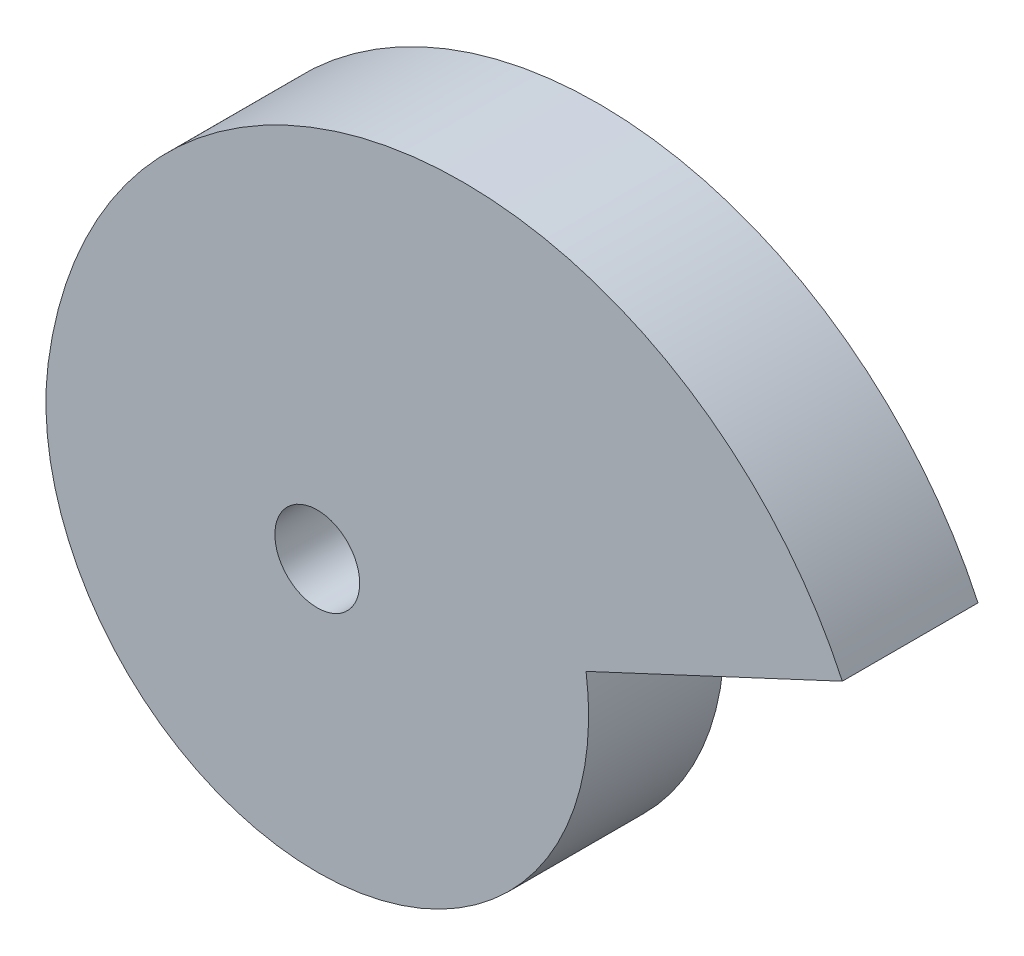
ISO-10303-21;
HEADER;
FILE_DESCRIPTION(('STEP AP214'),'2;1');
FILE_NAME('part.step','',(''),(''),'','','');
FILE_SCHEMA(('AUTOMOTIVE_DESIGN { 1 0 10303 214 1 1 1 1 }'));
ENDSEC;
DATA;
#1=APPLICATION_CONTEXT('core data for automotive mechanical design processes');
#2=APPLICATION_PROTOCOL_DEFINITION('international standard','automotive_design',2000,#1);
#3=PRODUCT_CONTEXT('',#1,'mechanical');
#4=PRODUCT('Part','Part','',(#3));
#5=PRODUCT_RELATED_PRODUCT_CATEGORY('part','',(#4));
#6=PRODUCT_DEFINITION_FORMATION('','',#4);
#7=PRODUCT_DEFINITION_CONTEXT('part definition',#1,'design');
#8=PRODUCT_DEFINITION('design','',#6,#7);
#9=PRODUCT_DEFINITION_SHAPE('','',#8);
#10=(LENGTH_UNIT() NAMED_UNIT(*) SI_UNIT(.MILLI.,.METRE.));
#11=(NAMED_UNIT(*) PLANE_ANGLE_UNIT() SI_UNIT($,.RADIAN.));
#12=(NAMED_UNIT(*) SI_UNIT($,.STERADIAN.) SOLID_ANGLE_UNIT());
#13=UNCERTAINTY_MEASURE_WITH_UNIT(LENGTH_MEASURE(1.E-05),#10,'distance_accuracy_value','');
#14=(GEOMETRIC_REPRESENTATION_CONTEXT(3) GLOBAL_UNCERTAINTY_ASSIGNED_CONTEXT((#13)) GLOBAL_UNIT_ASSIGNED_CONTEXT((#10,
#11,#12)) REPRESENTATION_CONTEXT('',''));
#15=CARTESIAN_POINT('',(0.,0.,0.));
#16=DIRECTION('',(0.,0.,1.));
#17=DIRECTION('',(1.,0.,0.));
#18=AXIS2_PLACEMENT_3D('',#15,#16,#17);
#19=CARTESIAN_POINT('',(42.9025100512141,-5.55899705018577,40.));
#20=DIRECTION('',(0.,0.,-1.));
#21=DIRECTION('',(-1.,0.,0.));
#22=AXIS2_PLACEMENT_3D('',#19,#20,#21);
#23=CYLINDRICAL_SURFACE('',#22,123.261158293537);
#24=CARTESIAN_POINT('',(42.9025100512141,-5.55899705018577,0.));
#25=DIRECTION('',(0.,0.,1.));
#26=DIRECTION('',(-1.,0.,0.));
#27=AXIS2_PLACEMENT_3D('',#24,#25,#26);
#28=CIRCLE('',#27,123.261158293537);
#29=CARTESIAN_POINT('',(154.789932001286,46.1567447817859,0.));
#30=VERTEX_POINT('',#29);
#31=CARTESIAN_POINT('',(-79.3367755160141,10.2798857348509,0.));
#32=VERTEX_POINT('',#31);
#33=EDGE_CURVE('E88',#30,#32,#28,.T.);
#34=ORIENTED_EDGE('',*,*,#33,.T.);
#35=DIRECTION('',(0.,0.,-1.));
#36=VECTOR('',#35,1.);
#37=CARTESIAN_POINT('',(-79.3367755160141,10.2798857348509,40.));
#38=LINE('',#37,#36);
#39=CARTESIAN_POINT('',(-79.3367755160141,10.2798857348509,40.));
#40=VERTEX_POINT('',#39);
#41=EDGE_CURVE('E11',#40,#32,#38,.T.);
#42=ORIENTED_EDGE('',*,*,#41,.F.);
#43=CARTESIAN_POINT('',(42.9025100512141,-5.55899705018577,40.));
#44=DIRECTION('',(0.,0.,1.));
#45=DIRECTION('',(-1.,0.,0.));
#46=AXIS2_PLACEMENT_3D('',#43,#44,#45);
#47=CIRCLE('',#46,123.261158293537);
#48=CARTESIAN_POINT('',(154.789932001286,46.1567447817859,40.));
#49=VERTEX_POINT('',#48);
#50=EDGE_CURVE('E81',#49,#40,#47,.T.);
#51=ORIENTED_EDGE('',*,*,#50,.F.);
#52=DIRECTION('',(0.,0.,-1.));
#53=VECTOR('',#52,1.);
#54=CARTESIAN_POINT('',(154.789932001286,46.1567447817859,40.));
#55=LINE('',#54,#53);
#56=EDGE_CURVE('E89',#49,#30,#55,.T.);
#57=ORIENTED_EDGE('',*,*,#56,.T.);
#58=EDGE_LOOP('',(#34,#42,#51,#57));
#59=FACE_BOUND('',#58,.T.);
#60=ADVANCED_FACE('F41',(#59),#23,.T.);
#61=CARTESIAN_POINT('',(0.,0.,40.));
#62=DIRECTION('',(0.,0.,-1.));
#63=DIRECTION('',(-1.,0.,0.));
#64=AXIS2_PLACEMENT_3D('',#61,#62,#63);
#65=CYLINDRICAL_SURFACE('',#64,80.);
#66=CARTESIAN_POINT('',(0.,0.,0.));
#67=DIRECTION('',(0.,0.,1.));
#68=DIRECTION('',(1.,0.,0.));
#69=AXIS2_PLACEMENT_3D('',#66,#67,#68);
#70=CIRCLE('',#69,80.);
#71=CARTESIAN_POINT('',(79.2528578289507,10.9080028393895,0.));
#72=VERTEX_POINT('',#71);
#73=EDGE_CURVE('E69',#32,#72,#70,.T.);
#74=ORIENTED_EDGE('',*,*,#73,.T.);
#75=DIRECTION('',(0.,0.,-1.));
#76=VECTOR('',#75,1.);
#77=CARTESIAN_POINT('',(79.2528578289507,10.9080028393895,40.));
#78=LINE('',#77,#76);
#79=CARTESIAN_POINT('',(79.2528578289507,10.9080028393895,40.));
#80=VERTEX_POINT('',#79);
#81=EDGE_CURVE('E49',#80,#72,#78,.T.);
#82=ORIENTED_EDGE('',*,*,#81,.F.);
#83=CARTESIAN_POINT('',(0.,0.,40.));
#84=DIRECTION('',(0.,0.,1.));
#85=DIRECTION('',(1.,0.,0.));
#86=AXIS2_PLACEMENT_3D('',#83,#84,#85);
#87=CIRCLE('',#86,80.);
#88=EDGE_CURVE('E77',#40,#80,#87,.T.);
#89=ORIENTED_EDGE('',*,*,#88,.F.);
#90=ORIENTED_EDGE('',*,*,#41,.T.);
#91=EDGE_LOOP('',(#74,#82,#89,#90));
#92=FACE_BOUND('',#91,.T.);
#93=ADVANCED_FACE('F78',(#92),#65,.T.);
#94=CARTESIAN_POINT('',(154.789932001286,46.1567447817859,40.));
#95=DIRECTION('',(-0.422866820036971,0.906191840898946,0.));
#96=DIRECTION('',(-0.906191840898946,-0.422866820036971,0.));
#97=AXIS2_PLACEMENT_3D('',#94,#95,#96);
#98=PLANE('',#97);
#99=DIRECTION('',(0.906191840898946,0.422866820036971,0.));
#100=VECTOR('',#99,1.);
#101=CARTESIAN_POINT('',(154.789932001286,46.1567447817859,0.));
#102=LINE('',#101,#100);
#103=EDGE_CURVE('E74',#72,#30,#102,.T.);
#104=ORIENTED_EDGE('',*,*,#103,.T.);
#105=ORIENTED_EDGE('',*,*,#56,.F.);
#106=DIRECTION('',(0.906191840898946,0.422866820036971,0.));
#107=VECTOR('',#106,1.);
#108=CARTESIAN_POINT('',(154.789932001286,46.1567447817859,40.));
#109=LINE('',#108,#107);
#110=EDGE_CURVE('E57',#80,#49,#109,.T.);
#111=ORIENTED_EDGE('',*,*,#110,.F.);
#112=ORIENTED_EDGE('',*,*,#81,.T.);
#113=EDGE_LOOP('',(#104,#105,#111,#112));
#114=FACE_BOUND('',#113,.T.);
#115=ADVANCED_FACE('F100',(#114),#98,.F.);
#116=CARTESIAN_POINT('',(42.9025100512141,-5.55899705018577,40.));
#117=DIRECTION('',(0.,0.,-1.));
#118=DIRECTION('',(-1.,0.,0.));
#119=AXIS2_PLACEMENT_3D('',#116,#117,#118);
#120=PLANE('',#119);
#121=CARTESIAN_POINT('',(0.,0.,40.));
#122=DIRECTION('',(0.,0.,1.));
#123=DIRECTION('',(1.,0.,0.));
#124=AXIS2_PLACEMENT_3D('',#121,#122,#123);
#125=CIRCLE('',#124,12.5);
#126=CARTESIAN_POINT('',(12.5,0.,40.));
#127=VERTEX_POINT('',#126);
#128=EDGE_CURVE('E95',#127,#127,#125,.T.);
#129=ORIENTED_EDGE('',*,*,#128,.F.);
#130=EDGE_LOOP('',(#129));
#131=FACE_BOUND('',#130,.T.);
#132=ORIENTED_EDGE('',*,*,#50,.T.);
#133=ORIENTED_EDGE('',*,*,#88,.T.);
#134=ORIENTED_EDGE('',*,*,#110,.T.);
#135=EDGE_LOOP('',(#132,#133,#134));
#136=FACE_BOUND('',#135,.T.);
#137=ADVANCED_FACE('F84',(#131,#136),#120,.F.);
#138=CARTESIAN_POINT('',(42.9025100512141,-5.55899705018577,0.));
#139=DIRECTION('',(0.,0.,-1.));
#140=DIRECTION('',(-1.,0.,0.));
#141=AXIS2_PLACEMENT_3D('',#138,#139,#140);
#142=PLANE('',#141);
#143=CARTESIAN_POINT('',(0.,0.,0.));
#144=DIRECTION('',(0.,0.,1.));
#145=DIRECTION('',(1.,0.,0.));
#146=AXIS2_PLACEMENT_3D('',#143,#144,#145);
#147=CIRCLE('',#146,12.5);
#148=CARTESIAN_POINT('',(12.5,0.,0.));
#149=VERTEX_POINT('',#148);
#150=EDGE_CURVE('E91',#149,#149,#147,.T.);
#151=ORIENTED_EDGE('',*,*,#150,.T.);
#152=EDGE_LOOP('',(#151));
#153=FACE_BOUND('',#152,.T.);
#154=ORIENTED_EDGE('',*,*,#33,.F.);
#155=ORIENTED_EDGE('',*,*,#103,.F.);
#156=ORIENTED_EDGE('',*,*,#73,.F.);
#157=EDGE_LOOP('',(#154,#155,#156));
#158=FACE_BOUND('',#157,.T.);
#159=ADVANCED_FACE('F101',(#153,#158),#142,.T.);
#160=CARTESIAN_POINT('',(0.,0.,0.));
#161=DIRECTION('',(0.,0.,1.));
#162=DIRECTION('',(1.,0.,0.));
#163=AXIS2_PLACEMENT_3D('',#160,#161,#162);
#164=CYLINDRICAL_SURFACE('',#163,12.5);
#165=ORIENTED_EDGE('',*,*,#150,.F.);
#166=EDGE_LOOP('',(#165));
#167=FACE_BOUND('',#166,.T.);
#168=ORIENTED_EDGE('',*,*,#128,.T.);
#169=EDGE_LOOP('',(#168));
#170=FACE_BOUND('',#169,.T.);
#171=ADVANCED_FACE('F103',(#167,#170),#164,.F.);
#172=CLOSED_SHELL('',(#60,#93,#115,#137,#159,#171));
#173=MANIFOLD_SOLID_BREP('B2',#172);
#174=ADVANCED_BREP_SHAPE_REPRESENTATION('',(#18,#173),#14);
#175=SHAPE_DEFINITION_REPRESENTATION(#9,#174);
ENDSEC;
END-ISO-10303-21;
